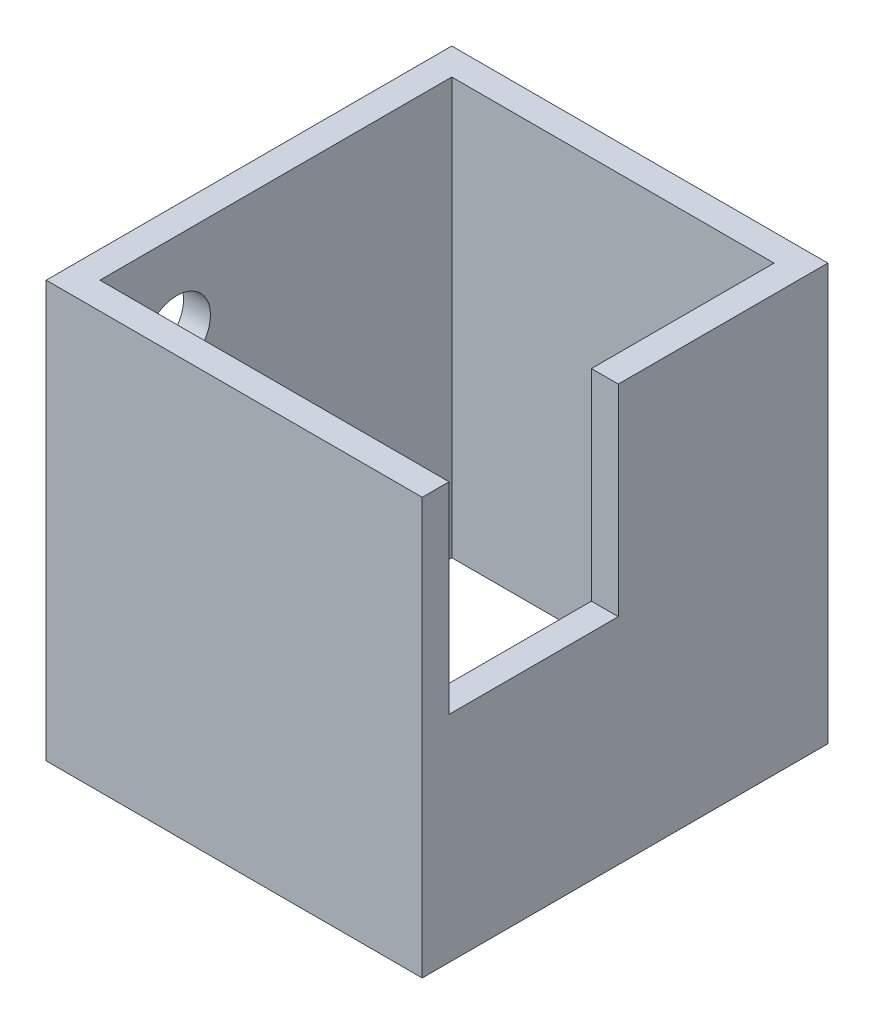
ISO-10303-21;
HEADER;
FILE_DESCRIPTION(('STEP AP214'),'2;1');
FILE_NAME('part.step','',(''),(''),'','','');
FILE_SCHEMA(('AUTOMOTIVE_DESIGN { 1 0 10303 214 1 1 1 1 }'));
ENDSEC;
DATA;
#1=APPLICATION_CONTEXT('core data for automotive mechanical design processes');
#2=APPLICATION_PROTOCOL_DEFINITION('international standard','automotive_design',2000,#1);
#3=PRODUCT_CONTEXT('',#1,'mechanical');
#4=PRODUCT('Part','Part','',(#3));
#5=PRODUCT_RELATED_PRODUCT_CATEGORY('part','',(#4));
#6=PRODUCT_DEFINITION_FORMATION('','',#4);
#7=PRODUCT_DEFINITION_CONTEXT('part definition',#1,'design');
#8=PRODUCT_DEFINITION('design','',#6,#7);
#9=PRODUCT_DEFINITION_SHAPE('','',#8);
#10=(LENGTH_UNIT() NAMED_UNIT(*) SI_UNIT(.MILLI.,.METRE.));
#11=(NAMED_UNIT(*) PLANE_ANGLE_UNIT() SI_UNIT($,.RADIAN.));
#12=(NAMED_UNIT(*) SI_UNIT($,.STERADIAN.) SOLID_ANGLE_UNIT());
#13=UNCERTAINTY_MEASURE_WITH_UNIT(LENGTH_MEASURE(1.E-05),#10,'distance_accuracy_value','');
#14=(GEOMETRIC_REPRESENTATION_CONTEXT(3) GLOBAL_UNCERTAINTY_ASSIGNED_CONTEXT((#13)) GLOBAL_UNIT_ASSIGNED_CONTEXT((#10,
#11,#12)) REPRESENTATION_CONTEXT('',''));
#15=CARTESIAN_POINT('',(0.,0.,0.));
#16=DIRECTION('',(0.,0.,1.));
#17=DIRECTION('',(1.,0.,0.));
#18=AXIS2_PLACEMENT_3D('',#15,#16,#17);
#19=CARTESIAN_POINT('',(2.,0.,-30.2));
#20=DIRECTION('',(1.,0.,0.));
#21=DIRECTION('',(0.,0.,1.));
#22=AXIS2_PLACEMENT_3D('',#19,#20,#21);
#23=PLANE('',#22);
#24=CARTESIAN_POINT('',(2.,24.64,-7.72826581115035));
#25=DIRECTION('',(-1.,0.,0.));
#26=DIRECTION('',(0.,0.,1.));
#27=AXIS2_PLACEMENT_3D('',#24,#25,#26);
#28=CIRCLE('',#27,2.5);
#29=CARTESIAN_POINT('',(2.,24.64,-5.22826581115035));
#30=VERTEX_POINT('',#29);
#31=EDGE_CURVE('E302',#30,#30,#28,.F.);
#32=ORIENTED_EDGE('',*,*,#31,.F.);
#33=EDGE_LOOP('',(#32));
#34=FACE_BOUND('',#33,.T.);
#35=DIRECTION('',(0.,0.,1.));
#36=VECTOR('',#35,1.);
#37=CARTESIAN_POINT('',(2.,2.,-30.2));
#38=LINE('',#37,#36);
#39=CARTESIAN_POINT('',(2.,2.,-15.6));
#40=VERTEX_POINT('',#39);
#41=CARTESIAN_POINT('',(2.,2.,-14.6));
#42=VERTEX_POINT('',#41);
#43=EDGE_CURVE('E183',#40,#42,#38,.T.);
#44=ORIENTED_EDGE('',*,*,#43,.F.);
#45=DIRECTION('',(0.,1.,0.));
#46=VECTOR('',#45,1.);
#47=CARTESIAN_POINT('',(2.,-0.00100000000000013,-15.6));
#48=LINE('',#47,#46);
#49=CARTESIAN_POINT('',(2.,0.,-15.6));
#50=VERTEX_POINT('',#49);
#51=EDGE_CURVE('E274',#50,#40,#48,.T.);
#52=ORIENTED_EDGE('',*,*,#51,.F.);
#53=DIRECTION('',(0.,0.,1.));
#54=VECTOR('',#53,1.);
#55=CARTESIAN_POINT('',(2.,0.,-28.2));
#56=LINE('',#55,#54);
#57=CARTESIAN_POINT('',(2.,0.,-28.2));
#58=VERTEX_POINT('',#57);
#59=EDGE_CURVE('E286',#58,#50,#56,.T.);
#60=ORIENTED_EDGE('',*,*,#59,.F.);
#61=DIRECTION('',(0.,-1.,0.));
#62=VECTOR('',#61,1.);
#63=CARTESIAN_POINT('',(2.,0.,-28.2));
#64=LINE('',#63,#62);
#65=CARTESIAN_POINT('',(2.,31.,-28.2));
#66=VERTEX_POINT('',#65);
#67=EDGE_CURVE('E188',#66,#58,#64,.T.);
#68=ORIENTED_EDGE('',*,*,#67,.F.);
#69=DIRECTION('',(0.,0.,1.));
#70=VECTOR('',#69,1.);
#71=CARTESIAN_POINT('',(2.,31.,-30.2));
#72=LINE('',#71,#70);
#73=CARTESIAN_POINT('',(2.,31.,-2.));
#74=VERTEX_POINT('',#73);
#75=EDGE_CURVE('E171',#66,#74,#72,.T.);
#76=ORIENTED_EDGE('',*,*,#75,.T.);
#77=DIRECTION('',(0.,-1.,0.));
#78=VECTOR('',#77,1.);
#79=CARTESIAN_POINT('',(2.,0.,-2.));
#80=LINE('',#79,#78);
#81=CARTESIAN_POINT('',(2.,3.5,-2.));
#82=VERTEX_POINT('',#81);
#83=EDGE_CURVE('E155',#74,#82,#80,.T.);
#84=ORIENTED_EDGE('',*,*,#83,.T.);
#85=DIRECTION('',(0.,0.,-1.));
#86=VECTOR('',#85,1.);
#87=CARTESIAN_POINT('',(2.,3.5,-14.6));
#88=LINE('',#87,#86);
#89=CARTESIAN_POINT('',(2.,3.5,-14.6));
#90=VERTEX_POINT('',#89);
#91=EDGE_CURVE('E164',#82,#90,#88,.T.);
#92=ORIENTED_EDGE('',*,*,#91,.T.);
#93=DIRECTION('',(0.,-1.,0.));
#94=VECTOR('',#93,1.);
#95=CARTESIAN_POINT('',(2.,3.5,-14.6));
#96=LINE('',#95,#94);
#97=EDGE_CURVE('E295',#90,#42,#96,.T.);
#98=ORIENTED_EDGE('',*,*,#97,.T.);
#99=EDGE_LOOP('',(#44,#52,#60,#68,#76,#84,#92,#98));
#100=FACE_BOUND('',#99,.T.);
#101=ADVANCED_FACE('F37',(#34,#100),#23,.T.);
#102=CARTESIAN_POINT('',(0.,2.,-30.2));
#103=DIRECTION('',(0.,1.,0.));
#104=DIRECTION('',(0.,0.,-1.));
#105=AXIS2_PLACEMENT_3D('',#102,#103,#104);
#106=PLANE('',#105);
#107=DIRECTION('',(0.,0.,1.));
#108=VECTOR('',#107,1.);
#109=CARTESIAN_POINT('',(26.,2.,-30.2));
#110=LINE('',#109,#108);
#111=CARTESIAN_POINT('',(26.,2.,-28.2));
#112=VERTEX_POINT('',#111);
#113=CARTESIAN_POINT('',(26.,2.,-14.6));
#114=VERTEX_POINT('',#113);
#115=EDGE_CURVE('E187',#112,#114,#110,.T.);
#116=ORIENTED_EDGE('',*,*,#115,.F.);
#117=DIRECTION('',(1.,0.,0.));
#118=VECTOR('',#117,1.);
#119=CARTESIAN_POINT('',(0.,2.,-28.2));
#120=LINE('',#119,#118);
#121=CARTESIAN_POINT('',(17.,2.,-28.2));
#122=VERTEX_POINT('',#121);
#123=EDGE_CURVE('E191',#122,#112,#120,.T.);
#124=ORIENTED_EDGE('',*,*,#123,.F.);
#125=DIRECTION('',(0.,0.,1.));
#126=VECTOR('',#125,1.);
#127=CARTESIAN_POINT('',(17.,2.,-28.2));
#128=LINE('',#127,#126);
#129=CARTESIAN_POINT('',(17.,2.,-15.6));
#130=VERTEX_POINT('',#129);
#131=EDGE_CURVE('E283',#122,#130,#128,.T.);
#132=ORIENTED_EDGE('',*,*,#131,.T.);
#133=DIRECTION('',(-1.,0.,0.));
#134=VECTOR('',#133,1.);
#135=CARTESIAN_POINT('',(2.,2.,-15.6));
#136=LINE('',#135,#134);
#137=EDGE_CURVE('E278',#130,#40,#136,.T.);
#138=ORIENTED_EDGE('',*,*,#137,.T.);
#139=ORIENTED_EDGE('',*,*,#43,.T.);
#140=DIRECTION('',(1.,0.,0.));
#141=VECTOR('',#140,1.);
#142=CARTESIAN_POINT('',(2.,2.,-14.6));
#143=LINE('',#142,#141);
#144=EDGE_CURVE('E59',#42,#114,#143,.T.);
#145=ORIENTED_EDGE('',*,*,#144,.T.);
#146=EDGE_LOOP('',(#116,#124,#132,#138,#139,#145));
#147=FACE_BOUND('',#146,.T.);
#148=ADVANCED_FACE('F319',(#147),#106,.T.);
#149=CARTESIAN_POINT('',(26.,0.,-30.2));
#150=DIRECTION('',(-1.,0.,0.));
#151=DIRECTION('',(0.,0.,-1.));
#152=AXIS2_PLACEMENT_3D('',#149,#150,#151);
#153=PLANE('',#152);
#154=DIRECTION('',(0.,0.,1.));
#155=VECTOR('',#154,1.);
#156=CARTESIAN_POINT('',(26.,3.5,-14.6));
#157=LINE('',#156,#155);
#158=CARTESIAN_POINT('',(26.,3.5,-14.6));
#159=VERTEX_POINT('',#158);
#160=CARTESIAN_POINT('',(26.,3.5,-2.));
#161=VERTEX_POINT('',#160);
#162=EDGE_CURVE('E161',#159,#161,#157,.T.);
#163=ORIENTED_EDGE('',*,*,#162,.T.);
#164=DIRECTION('',(0.,1.,0.));
#165=VECTOR('',#164,1.);
#166=CARTESIAN_POINT('',(26.,0.,-2.));
#167=LINE('',#166,#165);
#168=CARTESIAN_POINT('',(26.,16.,-2.));
#169=VERTEX_POINT('',#168);
#170=EDGE_CURVE('E158',#161,#169,#167,.T.);
#171=ORIENTED_EDGE('',*,*,#170,.T.);
#172=DIRECTION('',(0.,0.,1.));
#173=VECTOR('',#172,1.);
#174=CARTESIAN_POINT('',(26.,16.,-2.));
#175=LINE('',#174,#173);
#176=CARTESIAN_POINT('',(26.,16.,-14.6));
#177=VERTEX_POINT('',#176);
#178=EDGE_CURVE('E267',#177,#169,#175,.T.);
#179=ORIENTED_EDGE('',*,*,#178,.F.);
#180=DIRECTION('',(0.,-1.,0.));
#181=VECTOR('',#180,1.);
#182=CARTESIAN_POINT('',(26.,31.,-14.6));
#183=LINE('',#182,#181);
#184=CARTESIAN_POINT('',(26.,31.,-14.6));
#185=VERTEX_POINT('',#184);
#186=EDGE_CURVE('E270',#185,#177,#183,.T.);
#187=ORIENTED_EDGE('',*,*,#186,.F.);
#188=DIRECTION('',(0.,0.,1.));
#189=VECTOR('',#188,1.);
#190=CARTESIAN_POINT('',(26.,31.,-30.2));
#191=LINE('',#190,#189);
#192=CARTESIAN_POINT('',(26.,31.,-28.2));
#193=VERTEX_POINT('',#192);
#194=EDGE_CURVE('E194',#193,#185,#191,.T.);
#195=ORIENTED_EDGE('',*,*,#194,.F.);
#196=DIRECTION('',(0.,1.,0.));
#197=VECTOR('',#196,1.);
#198=CARTESIAN_POINT('',(26.,0.,-28.2));
#199=LINE('',#198,#197);
#200=EDGE_CURVE('E196',#112,#193,#199,.T.);
#201=ORIENTED_EDGE('',*,*,#200,.F.);
#202=ORIENTED_EDGE('',*,*,#115,.T.);
#203=DIRECTION('',(0.,-1.,0.));
#204=VECTOR('',#203,1.);
#205=CARTESIAN_POINT('',(26.,3.5,-14.6));
#206=LINE('',#205,#204);
#207=EDGE_CURVE('E160',#159,#114,#206,.T.);
#208=ORIENTED_EDGE('',*,*,#207,.F.);
#209=EDGE_LOOP('',(#163,#171,#179,#187,#195,#201,#202,#208));
#210=FACE_BOUND('',#209,.T.);
#211=ADVANCED_FACE('F325',(#210),#153,.T.);
#212=CARTESIAN_POINT('',(0.,0.,-2.));
#213=DIRECTION('',(0.,0.,1.));
#214=DIRECTION('',(-1.,0.,0.));
#215=AXIS2_PLACEMENT_3D('',#212,#213,#214);
#216=PLANE('',#215);
#217=DIRECTION('',(-1.,0.,0.));
#218=VECTOR('',#217,1.);
#219=CARTESIAN_POINT('',(2.,3.5,-2.));
#220=LINE('',#219,#218);
#221=EDGE_CURVE('E151',#161,#82,#220,.T.);
#222=ORIENTED_EDGE('',*,*,#221,.T.);
#223=ORIENTED_EDGE('',*,*,#83,.F.);
#224=DIRECTION('',(-1.,0.,0.));
#225=VECTOR('',#224,1.);
#226=CARTESIAN_POINT('',(0.,31.,-2.));
#227=LINE('',#226,#225);
#228=CARTESIAN_POINT('',(28.,31.,-2.));
#229=VERTEX_POINT('',#228);
#230=EDGE_CURVE('E174',#229,#74,#227,.T.);
#231=ORIENTED_EDGE('',*,*,#230,.F.);
#232=DIRECTION('',(0.,1.,0.));
#233=VECTOR('',#232,1.);
#234=CARTESIAN_POINT('',(28.,31.,-2.));
#235=LINE('',#234,#233);
#236=CARTESIAN_POINT('',(28.,16.,-2.));
#237=VERTEX_POINT('',#236);
#238=EDGE_CURVE('E263',#237,#229,#235,.T.);
#239=ORIENTED_EDGE('',*,*,#238,.F.);
#240=DIRECTION('',(1.,0.,0.));
#241=VECTOR('',#240,1.);
#242=CARTESIAN_POINT('',(-0.001000000000001,16.,-2.));
#243=LINE('',#242,#241);
#244=EDGE_CURVE('E172',#169,#237,#243,.T.);
#245=ORIENTED_EDGE('',*,*,#244,.F.);
#246=ORIENTED_EDGE('',*,*,#170,.F.);
#247=EDGE_LOOP('',(#222,#223,#231,#239,#245,#246));
#248=FACE_BOUND('',#247,.T.);
#249=ADVANCED_FACE('F152',(#248),#216,.F.);
#250=CARTESIAN_POINT('',(0.,31.,-30.2));
#251=DIRECTION('',(0.,-1.,0.));
#252=DIRECTION('',(0.,0.,1.));
#253=AXIS2_PLACEMENT_3D('',#250,#251,#252);
#254=PLANE('',#253);
#255=DIRECTION('',(0.,0.,1.));
#256=VECTOR('',#255,1.);
#257=CARTESIAN_POINT('',(28.,31.,-30.2));
#258=LINE('',#257,#256);
#259=CARTESIAN_POINT('',(28.,31.,-30.2));
#260=VERTEX_POINT('',#259);
#261=CARTESIAN_POINT('',(28.,31.,-14.6));
#262=VERTEX_POINT('',#261);
#263=EDGE_CURVE('E231',#260,#262,#258,.T.);
#264=ORIENTED_EDGE('',*,*,#263,.F.);
#265=DIRECTION('',(-1.,0.,0.));
#266=VECTOR('',#265,1.);
#267=CARTESIAN_POINT('',(0.,31.,-30.2));
#268=LINE('',#267,#266);
#269=CARTESIAN_POINT('',(0.,31.,-30.2));
#270=VERTEX_POINT('',#269);
#271=EDGE_CURVE('E215',#260,#270,#268,.T.);
#272=ORIENTED_EDGE('',*,*,#271,.T.);
#273=DIRECTION('',(0.,0.,1.));
#274=VECTOR('',#273,1.);
#275=CARTESIAN_POINT('',(0.,31.,-30.2));
#276=LINE('',#275,#274);
#277=CARTESIAN_POINT('',(0.,31.,0.));
#278=VERTEX_POINT('',#277);
#279=EDGE_CURVE('E218',#270,#278,#276,.T.);
#280=ORIENTED_EDGE('',*,*,#279,.T.);
#281=DIRECTION('',(-1.,0.,0.));
#282=VECTOR('',#281,1.);
#283=CARTESIAN_POINT('',(0.,31.,0.));
#284=LINE('',#283,#282);
#285=CARTESIAN_POINT('',(28.,31.,0.));
#286=VERTEX_POINT('',#285);
#287=EDGE_CURVE('E210',#286,#278,#284,.T.);
#288=ORIENTED_EDGE('',*,*,#287,.F.);
#289=EDGE_CURVE('E230',#229,#286,#258,.T.);
#290=ORIENTED_EDGE('',*,*,#289,.F.);
#291=ORIENTED_EDGE('',*,*,#230,.T.);
#292=ORIENTED_EDGE('',*,*,#75,.F.);
#293=DIRECTION('',(-1.,0.,0.));
#294=VECTOR('',#293,1.);
#295=CARTESIAN_POINT('',(0.,31.,-28.2));
#296=LINE('',#295,#294);
#297=EDGE_CURVE('E200',#193,#66,#296,.T.);
#298=ORIENTED_EDGE('',*,*,#297,.F.);
#299=ORIENTED_EDGE('',*,*,#194,.T.);
#300=DIRECTION('',(1.,0.,0.));
#301=VECTOR('',#300,1.);
#302=CARTESIAN_POINT('',(-0.001000000000001,31.,-14.6));
#303=LINE('',#302,#301);
#304=EDGE_CURVE('E181',#185,#262,#303,.T.);
#305=ORIENTED_EDGE('',*,*,#304,.T.);
#306=EDGE_LOOP('',(#264,#272,#280,#288,#290,#291,#292,#298,#299,#305));
#307=FACE_BOUND('',#306,.T.);
#308=ADVANCED_FACE('F255',(#307),#254,.F.);
#309=CARTESIAN_POINT('',(0.,0.,-30.2));
#310=DIRECTION('',(1.,0.,0.));
#311=DIRECTION('',(0.,0.,1.));
#312=AXIS2_PLACEMENT_3D('',#309,#310,#311);
#313=PLANE('',#312);
#314=CARTESIAN_POINT('',(0.,24.64,-7.72826581115035));
#315=DIRECTION('',(1.,0.,0.));
#316=DIRECTION('',(0.,0.,-1.));
#317=AXIS2_PLACEMENT_3D('',#314,#315,#316);
#318=CIRCLE('',#317,2.5);
#319=CARTESIAN_POINT('',(0.,24.64,-10.2282658111504));
#320=VERTEX_POINT('',#319);
#321=EDGE_CURVE('E298',#320,#320,#318,.T.);
#322=ORIENTED_EDGE('',*,*,#321,.T.);
#323=EDGE_LOOP('',(#322));
#324=FACE_BOUND('',#323,.T.);
#325=DIRECTION('',(0.,-1.,0.));
#326=VECTOR('',#325,1.);
#327=CARTESIAN_POINT('',(0.,0.,0.));
#328=LINE('',#327,#326);
#329=CARTESIAN_POINT('',(0.,0.,0.));
#330=VERTEX_POINT('',#329);
#331=EDGE_CURVE('E186',#278,#330,#328,.T.);
#332=ORIENTED_EDGE('',*,*,#331,.F.);
#333=ORIENTED_EDGE('',*,*,#279,.F.);
#334=DIRECTION('',(0.,-1.,0.));
#335=VECTOR('',#334,1.);
#336=CARTESIAN_POINT('',(0.,0.,-30.2));
#337=LINE('',#336,#335);
#338=CARTESIAN_POINT('',(0.,0.,-30.2));
#339=VERTEX_POINT('',#338);
#340=EDGE_CURVE('E206',#270,#339,#337,.T.);
#341=ORIENTED_EDGE('',*,*,#340,.T.);
#342=DIRECTION('',(0.,0.,1.));
#343=VECTOR('',#342,1.);
#344=CARTESIAN_POINT('',(0.,0.,-30.2));
#345=LINE('',#344,#343);
#346=EDGE_CURVE('E11',#339,#330,#345,.T.);
#347=ORIENTED_EDGE('',*,*,#346,.T.);
#348=EDGE_LOOP('',(#332,#333,#341,#347));
#349=FACE_BOUND('',#348,.T.);
#350=ADVANCED_FACE('F39',(#324,#349),#313,.F.);
#351=CARTESIAN_POINT('',(0.,0.,-30.2));
#352=DIRECTION('',(0.,1.,0.));
#353=DIRECTION('',(0.,0.,-1.));
#354=AXIS2_PLACEMENT_3D('',#351,#352,#353);
#355=PLANE('',#354);
#356=DIRECTION('',(1.,0.,0.));
#357=VECTOR('',#356,1.);
#358=CARTESIAN_POINT('',(2.,0.,-15.6));
#359=LINE('',#358,#357);
#360=CARTESIAN_POINT('',(17.,0.,-15.6));
#361=VERTEX_POINT('',#360);
#362=EDGE_CURVE('E289',#50,#361,#359,.T.);
#363=ORIENTED_EDGE('',*,*,#362,.T.);
#364=DIRECTION('',(0.,0.,-1.));
#365=VECTOR('',#364,1.);
#366=CARTESIAN_POINT('',(17.,0.,-28.2));
#367=LINE('',#366,#365);
#368=CARTESIAN_POINT('',(17.,0.,-28.2));
#369=VERTEX_POINT('',#368);
#370=EDGE_CURVE('E292',#361,#369,#367,.T.);
#371=ORIENTED_EDGE('',*,*,#370,.T.);
#372=DIRECTION('',(-1.,0.,0.));
#373=VECTOR('',#372,1.);
#374=CARTESIAN_POINT('',(2.,0.,-28.2));
#375=LINE('',#374,#373);
#376=EDGE_CURVE('E272',#369,#58,#375,.T.);
#377=ORIENTED_EDGE('',*,*,#376,.T.);
#378=ORIENTED_EDGE('',*,*,#59,.T.);
#379=EDGE_LOOP('',(#363,#371,#377,#378));
#380=FACE_BOUND('',#379,.T.);
#381=DIRECTION('',(1.,0.,0.));
#382=VECTOR('',#381,1.);
#383=CARTESIAN_POINT('',(0.,0.,0.));
#384=LINE('',#383,#382);
#385=CARTESIAN_POINT('',(28.,0.,0.));
#386=VERTEX_POINT('',#385);
#387=EDGE_CURVE('E221',#330,#386,#384,.T.);
#388=ORIENTED_EDGE('',*,*,#387,.F.);
#389=ORIENTED_EDGE('',*,*,#346,.F.);
#390=DIRECTION('',(1.,0.,0.));
#391=VECTOR('',#390,1.);
#392=CARTESIAN_POINT('',(0.,0.,-30.2));
#393=LINE('',#392,#391);
#394=CARTESIAN_POINT('',(28.,0.,-30.2));
#395=VERTEX_POINT('',#394);
#396=EDGE_CURVE('E209',#339,#395,#393,.T.);
#397=ORIENTED_EDGE('',*,*,#396,.T.);
#398=DIRECTION('',(0.,0.,1.));
#399=VECTOR('',#398,1.);
#400=CARTESIAN_POINT('',(28.,0.,-30.2));
#401=LINE('',#400,#399);
#402=EDGE_CURVE('E45',#395,#386,#401,.T.);
#403=ORIENTED_EDGE('',*,*,#402,.T.);
#404=EDGE_LOOP('',(#388,#389,#397,#403));
#405=FACE_BOUND('',#404,.T.);
#406=ADVANCED_FACE('F236',(#380,#405),#355,.F.);
#407=CARTESIAN_POINT('',(28.,0.,-30.2));
#408=DIRECTION('',(-1.,0.,0.));
#409=DIRECTION('',(0.,0.,-1.));
#410=AXIS2_PLACEMENT_3D('',#407,#408,#409);
#411=PLANE('',#410);
#412=DIRECTION('',(0.,0.,1.));
#413=VECTOR('',#412,1.);
#414=CARTESIAN_POINT('',(28.,16.,-2.));
#415=LINE('',#414,#413);
#416=CARTESIAN_POINT('',(28.,16.,-14.6));
#417=VERTEX_POINT('',#416);
#418=EDGE_CURVE('E260',#417,#237,#415,.T.);
#419=ORIENTED_EDGE('',*,*,#418,.T.);
#420=ORIENTED_EDGE('',*,*,#238,.T.);
#421=ORIENTED_EDGE('',*,*,#289,.T.);
#422=DIRECTION('',(0.,1.,0.));
#423=VECTOR('',#422,1.);
#424=CARTESIAN_POINT('',(28.,0.,0.));
#425=LINE('',#424,#423);
#426=EDGE_CURVE('E224',#386,#286,#425,.T.);
#427=ORIENTED_EDGE('',*,*,#426,.F.);
#428=ORIENTED_EDGE('',*,*,#402,.F.);
#429=DIRECTION('',(0.,1.,0.));
#430=VECTOR('',#429,1.);
#431=CARTESIAN_POINT('',(28.,0.,-30.2));
#432=LINE('',#431,#430);
#433=EDGE_CURVE('E213',#395,#260,#432,.T.);
#434=ORIENTED_EDGE('',*,*,#433,.T.);
#435=ORIENTED_EDGE('',*,*,#263,.T.);
#436=DIRECTION('',(0.,-1.,0.));
#437=VECTOR('',#436,1.);
#438=CARTESIAN_POINT('',(28.,31.,-14.6));
#439=LINE('',#438,#437);
#440=EDGE_CURVE('E251',#262,#417,#439,.T.);
#441=ORIENTED_EDGE('',*,*,#440,.T.);
#442=EDGE_LOOP('',(#419,#420,#421,#427,#428,#434,#435,#441));
#443=FACE_BOUND('',#442,.T.);
#444=ADVANCED_FACE('F249',(#443),#411,.F.);
#445=CARTESIAN_POINT('',(0.,0.,-30.2));
#446=DIRECTION('',(0.,0.,1.));
#447=DIRECTION('',(-1.,0.,0.));
#448=AXIS2_PLACEMENT_3D('',#445,#446,#447);
#449=PLANE('',#448);
#450=ORIENTED_EDGE('',*,*,#340,.F.);
#451=ORIENTED_EDGE('',*,*,#271,.F.);
#452=ORIENTED_EDGE('',*,*,#433,.F.);
#453=ORIENTED_EDGE('',*,*,#396,.F.);
#454=EDGE_LOOP('',(#450,#451,#452,#453));
#455=FACE_BOUND('',#454,.T.);
#456=ADVANCED_FACE('F247',(#455),#449,.F.);
#457=CARTESIAN_POINT('',(0.,0.,0.));
#458=DIRECTION('',(0.,0.,1.));
#459=DIRECTION('',(-1.,0.,0.));
#460=AXIS2_PLACEMENT_3D('',#457,#458,#459);
#461=PLANE('',#460);
#462=ORIENTED_EDGE('',*,*,#331,.T.);
#463=ORIENTED_EDGE('',*,*,#387,.T.);
#464=ORIENTED_EDGE('',*,*,#426,.T.);
#465=ORIENTED_EDGE('',*,*,#287,.T.);
#466=EDGE_LOOP('',(#462,#463,#464,#465));
#467=FACE_BOUND('',#466,.T.);
#468=ADVANCED_FACE('F240',(#467),#461,.T.);
#469=CARTESIAN_POINT('',(0.,0.,-28.2));
#470=DIRECTION('',(0.,0.,1.));
#471=DIRECTION('',(-1.,0.,0.));
#472=AXIS2_PLACEMENT_3D('',#469,#470,#471);
#473=PLANE('',#472);
#474=ORIENTED_EDGE('',*,*,#67,.T.);
#475=ORIENTED_EDGE('',*,*,#376,.F.);
#476=DIRECTION('',(0.,1.,0.));
#477=VECTOR('',#476,1.);
#478=CARTESIAN_POINT('',(17.,-0.00100000000000013,-28.2));
#479=LINE('',#478,#477);
#480=EDGE_CURVE('E275',#369,#122,#479,.T.);
#481=ORIENTED_EDGE('',*,*,#480,.T.);
#482=ORIENTED_EDGE('',*,*,#123,.T.);
#483=ORIENTED_EDGE('',*,*,#200,.T.);
#484=ORIENTED_EDGE('',*,*,#297,.T.);
#485=EDGE_LOOP('',(#474,#475,#481,#482,#483,#484));
#486=FACE_BOUND('',#485,.T.);
#487=ADVANCED_FACE('F336',(#486),#473,.T.);
#488=CARTESIAN_POINT('',(-0.001000000000001,31.,-14.6));
#489=DIRECTION('',(0.,0.,-1.));
#490=DIRECTION('',(0.,-1.,0.));
#491=AXIS2_PLACEMENT_3D('',#488,#489,#490);
#492=PLANE('',#491);
#493=ORIENTED_EDGE('',*,*,#304,.F.);
#494=ORIENTED_EDGE('',*,*,#186,.T.);
#495=DIRECTION('',(1.,0.,0.));
#496=VECTOR('',#495,1.);
#497=CARTESIAN_POINT('',(-0.001000000000001,16.,-14.6));
#498=LINE('',#497,#496);
#499=EDGE_CURVE('E177',#177,#417,#498,.T.);
#500=ORIENTED_EDGE('',*,*,#499,.T.);
#501=ORIENTED_EDGE('',*,*,#440,.F.);
#502=EDGE_LOOP('',(#493,#494,#500,#501));
#503=FACE_BOUND('',#502,.T.);
#504=ADVANCED_FACE('F330',(#503),#492,.F.);
#505=CARTESIAN_POINT('',(-0.001000000000001,16.,-2.));
#506=DIRECTION('',(0.,-1.,0.));
#507=DIRECTION('',(0.,0.,1.));
#508=AXIS2_PLACEMENT_3D('',#505,#506,#507);
#509=PLANE('',#508);
#510=ORIENTED_EDGE('',*,*,#499,.F.);
#511=ORIENTED_EDGE('',*,*,#178,.T.);
#512=ORIENTED_EDGE('',*,*,#244,.T.);
#513=ORIENTED_EDGE('',*,*,#418,.F.);
#514=EDGE_LOOP('',(#510,#511,#512,#513));
#515=FACE_BOUND('',#514,.T.);
#516=ADVANCED_FACE('F368',(#515),#509,.F.);
#517=CARTESIAN_POINT('',(2.,-0.00100000000000013,-15.6));
#518=DIRECTION('',(0.,0.,1.));
#519=DIRECTION('',(-1.,0.,0.));
#520=AXIS2_PLACEMENT_3D('',#517,#518,#519);
#521=PLANE('',#520);
#522=ORIENTED_EDGE('',*,*,#362,.F.);
#523=ORIENTED_EDGE('',*,*,#51,.T.);
#524=ORIENTED_EDGE('',*,*,#137,.F.);
#525=DIRECTION('',(0.,1.,0.));
#526=VECTOR('',#525,1.);
#527=CARTESIAN_POINT('',(17.,-0.00100000000000013,-15.6));
#528=LINE('',#527,#526);
#529=EDGE_CURVE('E277',#361,#130,#528,.T.);
#530=ORIENTED_EDGE('',*,*,#529,.F.);
#531=EDGE_LOOP('',(#522,#523,#524,#530));
#532=FACE_BOUND('',#531,.T.);
#533=ADVANCED_FACE('F358',(#532),#521,.F.);
#534=CARTESIAN_POINT('',(17.,-0.00100000000000013,-28.2));
#535=DIRECTION('',(1.,0.,0.));
#536=DIRECTION('',(0.,0.,1.));
#537=AXIS2_PLACEMENT_3D('',#534,#535,#536);
#538=PLANE('',#537);
#539=ORIENTED_EDGE('',*,*,#370,.F.);
#540=ORIENTED_EDGE('',*,*,#529,.T.);
#541=ORIENTED_EDGE('',*,*,#131,.F.);
#542=ORIENTED_EDGE('',*,*,#480,.F.);
#543=EDGE_LOOP('',(#539,#540,#541,#542));
#544=FACE_BOUND('',#543,.T.);
#545=ADVANCED_FACE('F362',(#544),#538,.F.);
#546=CARTESIAN_POINT('',(2.,3.5,-14.6));
#547=DIRECTION('',(0.,0.,1.));
#548=DIRECTION('',(-1.,0.,0.));
#549=AXIS2_PLACEMENT_3D('',#546,#547,#548);
#550=PLANE('',#549);
#551=ORIENTED_EDGE('',*,*,#144,.F.);
#552=ORIENTED_EDGE('',*,*,#97,.F.);
#553=DIRECTION('',(1.,0.,0.));
#554=VECTOR('',#553,1.);
#555=CARTESIAN_POINT('',(2.,3.5,-14.6));
#556=LINE('',#555,#554);
#557=EDGE_CURVE('E52',#90,#159,#556,.T.);
#558=ORIENTED_EDGE('',*,*,#557,.T.);
#559=ORIENTED_EDGE('',*,*,#207,.T.);
#560=EDGE_LOOP('',(#551,#552,#558,#559));
#561=FACE_BOUND('',#560,.T.);
#562=ADVANCED_FACE('F316',(#561),#550,.F.);
#563=CARTESIAN_POINT('',(0.,3.5,0.));
#564=DIRECTION('',(0.,-1.,0.));
#565=DIRECTION('',(0.,0.,1.));
#566=AXIS2_PLACEMENT_3D('',#563,#564,#565);
#567=PLANE('',#566);
#568=ORIENTED_EDGE('',*,*,#91,.F.);
#569=ORIENTED_EDGE('',*,*,#221,.F.);
#570=ORIENTED_EDGE('',*,*,#162,.F.);
#571=ORIENTED_EDGE('',*,*,#557,.F.);
#572=EDGE_LOOP('',(#568,#569,#570,#571));
#573=FACE_BOUND('',#572,.T.);
#574=ADVANCED_FACE('F165',(#573),#567,.F.);
#575=CARTESIAN_POINT('',(28.001,24.64,-7.72826581115035));
#576=DIRECTION('',(-1.,0.,0.));
#577=DIRECTION('',(0.,0.,-1.));
#578=AXIS2_PLACEMENT_3D('',#575,#576,#577);
#579=CYLINDRICAL_SURFACE('',#578,2.5);
#580=ORIENTED_EDGE('',*,*,#31,.T.);
#581=EDGE_LOOP('',(#580));
#582=FACE_BOUND('',#581,.T.);
#583=ORIENTED_EDGE('',*,*,#321,.F.);
#584=EDGE_LOOP('',(#583));
#585=FACE_BOUND('',#584,.T.);
#586=ADVANCED_FACE('F309',(#582,#585),#579,.F.);
#587=CLOSED_SHELL('',(#101,#148,#211,#249,#308,#350,#406,#444,#456,#468,#487,#504,#516,#533,
#545,#562,#574,#586));
#588=MANIFOLD_SOLID_BREP('B2',#587);
#589=ADVANCED_BREP_SHAPE_REPRESENTATION('',(#18,#588),#14);
#590=SHAPE_DEFINITION_REPRESENTATION(#9,#589);
ENDSEC;
END-ISO-10303-21;
